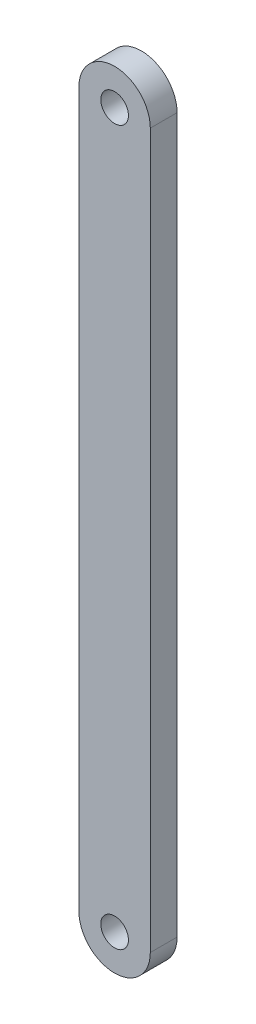
ISO-10303-21;
HEADER;
FILE_DESCRIPTION(('STEP AP214'),'2;1');
FILE_NAME('part.step','',(''),(''),'','','');
FILE_SCHEMA(('AUTOMOTIVE_DESIGN { 1 0 10303 214 1 1 1 1 }'));
ENDSEC;
DATA;
#1=APPLICATION_CONTEXT('core data for automotive mechanical design processes');
#2=APPLICATION_PROTOCOL_DEFINITION('international standard','automotive_design',2000,#1);
#3=PRODUCT_CONTEXT('',#1,'mechanical');
#4=PRODUCT('Part','Part','',(#3));
#5=PRODUCT_RELATED_PRODUCT_CATEGORY('part','',(#4));
#6=PRODUCT_DEFINITION_FORMATION('','',#4);
#7=PRODUCT_DEFINITION_CONTEXT('part definition',#1,'design');
#8=PRODUCT_DEFINITION('design','',#6,#7);
#9=PRODUCT_DEFINITION_SHAPE('','',#8);
#10=(LENGTH_UNIT() NAMED_UNIT(*) SI_UNIT(.MILLI.,.METRE.));
#11=(NAMED_UNIT(*) PLANE_ANGLE_UNIT() SI_UNIT($,.RADIAN.));
#12=(NAMED_UNIT(*) SI_UNIT($,.STERADIAN.) SOLID_ANGLE_UNIT());
#13=UNCERTAINTY_MEASURE_WITH_UNIT(LENGTH_MEASURE(1.E-05),#10,'distance_accuracy_value','');
#14=(GEOMETRIC_REPRESENTATION_CONTEXT(3) GLOBAL_UNCERTAINTY_ASSIGNED_CONTEXT((#13)) GLOBAL_UNIT_ASSIGNED_CONTEXT((#10,
#11,#12)) REPRESENTATION_CONTEXT('',''));
#15=CARTESIAN_POINT('',(0.,0.,0.));
#16=DIRECTION('',(0.,0.,1.));
#17=DIRECTION('',(1.,0.,0.));
#18=AXIS2_PLACEMENT_3D('',#15,#16,#17);
#19=CARTESIAN_POINT('',(59.999999998387,79.9999991908181,3.));
#20=DIRECTION('',(0.,0.,1.));
#21=DIRECTION('',(1.,0.,0.));
#22=AXIS2_PLACEMENT_3D('',#19,#20,#21);
#23=PLANE('',#22);
#24=CARTESIAN_POINT('',(59.999999998387,79.9999991908181,3.));
#25=DIRECTION('',(0.,0.,1.));
#26=DIRECTION('',(1.,0.,0.));
#27=AXIS2_PLACEMENT_3D('',#24,#25,#26);
#28=CIRCLE('',#27,1.55000000161296);
#29=CARTESIAN_POINT('',(61.55,79.9999991908181,3.));
#30=VERTEX_POINT('',#29);
#31=EDGE_CURVE('E100',#30,#30,#28,.T.);
#32=ORIENTED_EDGE('',*,*,#31,.F.);
#33=EDGE_LOOP('',(#32));
#34=FACE_BOUND('',#33,.T.);
#35=CARTESIAN_POINT('',(59.999999998387,79.9999991908181,3.));
#36=DIRECTION('',(0.,0.,1.));
#37=DIRECTION('',(1.,0.,0.));
#38=AXIS2_PLACEMENT_3D('',#35,#36,#37);
#39=CIRCLE('',#38,3.99999999999994);
#40=CARTESIAN_POINT('',(63.9999999999999,79.9999991918061,3.));
#41=VERTEX_POINT('',#40);
#42=CARTESIAN_POINT('',(56.,79.9999991924312,3.));
#43=VERTEX_POINT('',#42);
#44=EDGE_CURVE('E85',#41,#43,#39,.T.);
#45=ORIENTED_EDGE('',*,*,#44,.T.);
#46=DIRECTION('',(0.,-1.,0.));
#47=VECTOR('',#46,1.);
#48=CARTESIAN_POINT('',(56.,79.9999991924312,3.));
#49=LINE('',#48,#47);
#50=CARTESIAN_POINT('',(55.999999998387,-8.0621811048873E-07,3.));
#51=VERTEX_POINT('',#50);
#52=EDGE_CURVE('E80',#43,#51,#49,.T.);
#53=ORIENTED_EDGE('',*,*,#52,.T.);
#54=CARTESIAN_POINT('',(59.999999998387,-8.091818771E-07,3.));
#55=DIRECTION('',(0.,0.,1.));
#56=DIRECTION('',(1.,0.,0.));
#57=AXIS2_PLACEMENT_3D('',#54,#55,#56);
#58=CIRCLE('',#57,4.);
#59=CARTESIAN_POINT('',(64.,-8.072656925E-07,3.));
#60=VERTEX_POINT('',#59);
#61=EDGE_CURVE('E83',#51,#60,#58,.T.);
#62=ORIENTED_EDGE('',*,*,#61,.T.);
#63=DIRECTION('',(0.,1.,0.));
#64=VECTOR('',#63,1.);
#65=CARTESIAN_POINT('',(63.9999999999999,79.9999991918061,3.));
#66=LINE('',#65,#64);
#67=EDGE_CURVE('E50',#60,#41,#66,.T.);
#68=ORIENTED_EDGE('',*,*,#67,.T.);
#69=EDGE_LOOP('',(#45,#53,#62,#68));
#70=FACE_BOUND('',#69,.T.);
#71=CARTESIAN_POINT('',(59.999999998387,-8.091818771E-07,3.));
#72=DIRECTION('',(0.,0.,1.));
#73=DIRECTION('',(1.,0.,0.));
#74=AXIS2_PLACEMENT_3D('',#71,#72,#73);
#75=CIRCLE('',#74,1.55000000161296);
#76=CARTESIAN_POINT('',(61.55,-8.091818771E-07,3.));
#77=VERTEX_POINT('',#76);
#78=EDGE_CURVE('E115',#77,#77,#75,.T.);
#79=ORIENTED_EDGE('',*,*,#78,.F.);
#80=EDGE_LOOP('',(#79));
#81=FACE_BOUND('',#80,.T.);
#82=ADVANCED_FACE('F33',(#34,#70,#81),#23,.T.);
#83=CARTESIAN_POINT('',(59.999999998387,79.9999991908181,0.));
#84=DIRECTION('',(0.,0.,1.));
#85=DIRECTION('',(1.,0.,0.));
#86=AXIS2_PLACEMENT_3D('',#83,#84,#85);
#87=PLANE('',#86);
#88=CARTESIAN_POINT('',(59.999999998387,79.9999991908181,0.));
#89=DIRECTION('',(0.,0.,1.));
#90=DIRECTION('',(1.,0.,0.));
#91=AXIS2_PLACEMENT_3D('',#88,#89,#90);
#92=CIRCLE('',#91,3.99999999999994);
#93=CARTESIAN_POINT('',(63.9999999999999,79.9999991918061,0.));
#94=VERTEX_POINT('',#93);
#95=CARTESIAN_POINT('',(56.,79.9999991924312,0.));
#96=VERTEX_POINT('',#95);
#97=EDGE_CURVE('E97',#94,#96,#92,.T.);
#98=ORIENTED_EDGE('',*,*,#97,.F.);
#99=DIRECTION('',(0.,1.,0.));
#100=VECTOR('',#99,1.);
#101=CARTESIAN_POINT('',(63.9999999999999,79.9999991918061,0.));
#102=LINE('',#101,#100);
#103=CARTESIAN_POINT('',(64.,-8.072656925E-07,0.));
#104=VERTEX_POINT('',#103);
#105=EDGE_CURVE('E73',#104,#94,#102,.T.);
#106=ORIENTED_EDGE('',*,*,#105,.F.);
#107=CARTESIAN_POINT('',(59.999999998387,-8.091818771E-07,0.));
#108=DIRECTION('',(0.,0.,1.));
#109=DIRECTION('',(1.,0.,0.));
#110=AXIS2_PLACEMENT_3D('',#107,#108,#109);
#111=CIRCLE('',#110,4.);
#112=CARTESIAN_POINT('',(55.999999998387,-8.0621811048873E-07,0.));
#113=VERTEX_POINT('',#112);
#114=EDGE_CURVE('E67',#113,#104,#111,.T.);
#115=ORIENTED_EDGE('',*,*,#114,.F.);
#116=DIRECTION('',(0.,-1.,0.));
#117=VECTOR('',#116,1.);
#118=CARTESIAN_POINT('',(56.,79.9999991924312,0.));
#119=LINE('',#118,#117);
#120=EDGE_CURVE('E89',#96,#113,#119,.T.);
#121=ORIENTED_EDGE('',*,*,#120,.F.);
#122=EDGE_LOOP('',(#98,#106,#115,#121));
#123=FACE_BOUND('',#122,.T.);
#124=CARTESIAN_POINT('',(59.999999998387,79.9999991908181,0.));
#125=DIRECTION('',(0.,0.,1.));
#126=DIRECTION('',(1.,0.,0.));
#127=AXIS2_PLACEMENT_3D('',#124,#125,#126);
#128=CIRCLE('',#127,1.55000000161296);
#129=CARTESIAN_POINT('',(61.55,79.9999991908181,0.));
#130=VERTEX_POINT('',#129);
#131=EDGE_CURVE('E112',#130,#130,#128,.T.);
#132=ORIENTED_EDGE('',*,*,#131,.T.);
#133=EDGE_LOOP('',(#132));
#134=FACE_BOUND('',#133,.T.);
#135=CARTESIAN_POINT('',(59.999999998387,-8.091818771E-07,0.));
#136=DIRECTION('',(0.,0.,1.));
#137=DIRECTION('',(1.,0.,0.));
#138=AXIS2_PLACEMENT_3D('',#135,#136,#137);
#139=CIRCLE('',#138,1.55000000161296);
#140=CARTESIAN_POINT('',(61.55,-8.091818771E-07,0.));
#141=VERTEX_POINT('',#140);
#142=EDGE_CURVE('E118',#141,#141,#139,.T.);
#143=ORIENTED_EDGE('',*,*,#142,.T.);
#144=EDGE_LOOP('',(#143));
#145=FACE_BOUND('',#144,.T.);
#146=ADVANCED_FACE('F108',(#123,#134,#145),#87,.F.);
#147=CARTESIAN_POINT('',(59.999999998387,79.9999991908181,3.));
#148=DIRECTION('',(0.,0.,-1.));
#149=DIRECTION('',(-1.,0.,0.));
#150=AXIS2_PLACEMENT_3D('',#147,#148,#149);
#151=CYLINDRICAL_SURFACE('',#150,3.99999999999994);
#152=ORIENTED_EDGE('',*,*,#97,.T.);
#153=DIRECTION('',(0.,0.,-1.));
#154=VECTOR('',#153,1.);
#155=CARTESIAN_POINT('',(56.,79.9999991924312,3.));
#156=LINE('',#155,#154);
#157=EDGE_CURVE('E11',#43,#96,#156,.T.);
#158=ORIENTED_EDGE('',*,*,#157,.F.);
#159=ORIENTED_EDGE('',*,*,#44,.F.);
#160=DIRECTION('',(0.,0.,-1.));
#161=VECTOR('',#160,1.);
#162=CARTESIAN_POINT('',(63.9999999999999,79.9999991918061,3.));
#163=LINE('',#162,#161);
#164=EDGE_CURVE('E93',#41,#94,#163,.T.);
#165=ORIENTED_EDGE('',*,*,#164,.T.);
#166=EDGE_LOOP('',(#152,#158,#159,#165));
#167=FACE_BOUND('',#166,.T.);
#168=ADVANCED_FACE('F35',(#167),#151,.T.);
#169=CARTESIAN_POINT('',(56.,79.9999991924312,3.));
#170=DIRECTION('',(1.,0.,0.));
#171=DIRECTION('',(0.,0.,-1.));
#172=AXIS2_PLACEMENT_3D('',#169,#170,#171);
#173=PLANE('',#172);
#174=ORIENTED_EDGE('',*,*,#120,.T.);
#175=DIRECTION('',(0.,0.,-1.));
#176=VECTOR('',#175,1.);
#177=CARTESIAN_POINT('',(55.999999998387,-8.0621811048873E-07,3.));
#178=LINE('',#177,#176);
#179=EDGE_CURVE('E42',#51,#113,#178,.T.);
#180=ORIENTED_EDGE('',*,*,#179,.F.);
#181=ORIENTED_EDGE('',*,*,#52,.F.);
#182=ORIENTED_EDGE('',*,*,#157,.T.);
#183=EDGE_LOOP('',(#174,#180,#181,#182));
#184=FACE_BOUND('',#183,.T.);
#185=ADVANCED_FACE('F88',(#184),#173,.F.);
#186=CARTESIAN_POINT('',(59.999999998387,-8.091818771E-07,3.));
#187=DIRECTION('',(0.,0.,-1.));
#188=DIRECTION('',(-1.,0.,0.));
#189=AXIS2_PLACEMENT_3D('',#186,#187,#188);
#190=CYLINDRICAL_SURFACE('',#189,4.);
#191=ORIENTED_EDGE('',*,*,#114,.T.);
#192=DIRECTION('',(0.,0.,-1.));
#193=VECTOR('',#192,1.);
#194=CARTESIAN_POINT('',(64.,-8.072656925E-07,3.));
#195=LINE('',#194,#193);
#196=EDGE_CURVE('E90',#60,#104,#195,.T.);
#197=ORIENTED_EDGE('',*,*,#196,.F.);
#198=ORIENTED_EDGE('',*,*,#61,.F.);
#199=ORIENTED_EDGE('',*,*,#179,.T.);
#200=EDGE_LOOP('',(#191,#197,#198,#199));
#201=FACE_BOUND('',#200,.T.);
#202=ADVANCED_FACE('F91',(#201),#190,.T.);
#203=CARTESIAN_POINT('',(63.9999999999999,79.9999991918061,3.));
#204=DIRECTION('',(-1.,0.,0.));
#205=DIRECTION('',(0.,-1.,0.));
#206=AXIS2_PLACEMENT_3D('',#203,#204,#205);
#207=PLANE('',#206);
#208=ORIENTED_EDGE('',*,*,#105,.T.);
#209=ORIENTED_EDGE('',*,*,#164,.F.);
#210=ORIENTED_EDGE('',*,*,#67,.F.);
#211=ORIENTED_EDGE('',*,*,#196,.T.);
#212=EDGE_LOOP('',(#208,#209,#210,#211));
#213=FACE_BOUND('',#212,.T.);
#214=ADVANCED_FACE('F105',(#213),#207,.F.);
#215=CARTESIAN_POINT('',(59.999999998387,79.9999991908181,3.));
#216=DIRECTION('',(0.,0.,-1.));
#217=DIRECTION('',(-1.,0.,0.));
#218=AXIS2_PLACEMENT_3D('',#215,#216,#217);
#219=CYLINDRICAL_SURFACE('',#218,1.55000000161296);
#220=ORIENTED_EDGE('',*,*,#31,.T.);
#221=EDGE_LOOP('',(#220));
#222=FACE_BOUND('',#221,.T.);
#223=ORIENTED_EDGE('',*,*,#131,.F.);
#224=EDGE_LOOP('',(#223));
#225=FACE_BOUND('',#224,.T.);
#226=ADVANCED_FACE('F135',(#222,#225),#219,.F.);
#227=CARTESIAN_POINT('',(59.999999998387,-8.091818771E-07,3.));
#228=DIRECTION('',(0.,0.,-1.));
#229=DIRECTION('',(-1.,0.,0.));
#230=AXIS2_PLACEMENT_3D('',#227,#228,#229);
#231=CYLINDRICAL_SURFACE('',#230,1.55000000161296);
#232=ORIENTED_EDGE('',*,*,#78,.T.);
#233=EDGE_LOOP('',(#232));
#234=FACE_BOUND('',#233,.T.);
#235=ORIENTED_EDGE('',*,*,#142,.F.);
#236=EDGE_LOOP('',(#235));
#237=FACE_BOUND('',#236,.T.);
#238=ADVANCED_FACE('F124',(#234,#237),#231,.F.);
#239=CLOSED_SHELL('',(#82,#146,#168,#185,#202,#214,#226,#238));
#240=MANIFOLD_SOLID_BREP('B2',#239);
#241=ADVANCED_BREP_SHAPE_REPRESENTATION('',(#18,#240),#14);
#242=SHAPE_DEFINITION_REPRESENTATION(#9,#241);
ENDSEC;
END-ISO-10303-21;
